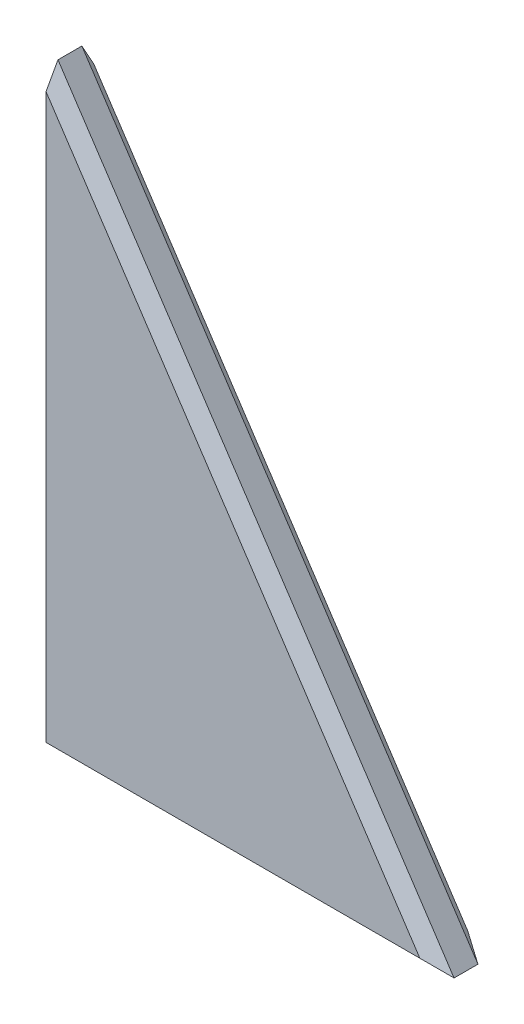
ISO-10303-21;
HEADER;
FILE_DESCRIPTION(('STEP AP214'),'2;1');
FILE_NAME('part.step','',(''),(''),'','','');
FILE_SCHEMA(('AUTOMOTIVE_DESIGN { 1 0 10303 214 1 1 1 1 }'));
ENDSEC;
DATA;
#1=APPLICATION_CONTEXT('core data for automotive mechanical design processes');
#2=APPLICATION_PROTOCOL_DEFINITION('international standard','automotive_design',2000,#1);
#3=PRODUCT_CONTEXT('',#1,'mechanical');
#4=PRODUCT('Part','Part','',(#3));
#5=PRODUCT_RELATED_PRODUCT_CATEGORY('part','',(#4));
#6=PRODUCT_DEFINITION_FORMATION('','',#4);
#7=PRODUCT_DEFINITION_CONTEXT('part definition',#1,'design');
#8=PRODUCT_DEFINITION('design','',#6,#7);
#9=PRODUCT_DEFINITION_SHAPE('','',#8);
#10=(LENGTH_UNIT() NAMED_UNIT(*) SI_UNIT(.MILLI.,.METRE.));
#11=(NAMED_UNIT(*) PLANE_ANGLE_UNIT() SI_UNIT($,.RADIAN.));
#12=(NAMED_UNIT(*) SI_UNIT($,.STERADIAN.) SOLID_ANGLE_UNIT());
#13=UNCERTAINTY_MEASURE_WITH_UNIT(LENGTH_MEASURE(1.E-05),#10,'distance_accuracy_value','');
#14=(GEOMETRIC_REPRESENTATION_CONTEXT(3) GLOBAL_UNCERTAINTY_ASSIGNED_CONTEXT((#13)) GLOBAL_UNIT_ASSIGNED_CONTEXT((#10,
#11,#12)) REPRESENTATION_CONTEXT('',''));
#15=CARTESIAN_POINT('',(0.,0.,0.));
#16=DIRECTION('',(0.,0.,1.));
#17=DIRECTION('',(1.,0.,0.));
#18=AXIS2_PLACEMENT_3D('',#15,#16,#17);
#19=CARTESIAN_POINT('',(0.,0.,2.54));
#20=DIRECTION('',(1.,0.,0.));
#21=DIRECTION('',(0.,0.,-1.));
#22=AXIS2_PLACEMENT_3D('',#19,#20,#21);
#23=PLANE('',#22);
#24=DIRECTION('',(0.,-1.,0.));
#25=VECTOR('',#24,1.);
#26=CARTESIAN_POINT('',(0.,0.,-2.54));
#27=LINE('',#26,#25);
#28=CARTESIAN_POINT('',(0.,61.2024835543174,-2.54));
#29=VERTEX_POINT('',#28);
#30=CARTESIAN_POINT('',(0.,1.27000000000001,-2.54));
#31=VERTEX_POINT('',#30);
#32=EDGE_CURVE('E111',#29,#31,#27,.T.);
#33=ORIENTED_EDGE('',*,*,#32,.T.);
#34=DIRECTION('',(0.,-0.707106781186547,0.707106781186548));
#35=VECTOR('',#34,1.);
#36=CARTESIAN_POINT('',(0.,0.,-1.26999999999999));
#37=LINE('',#36,#35);
#38=CARTESIAN_POINT('',(0.,0.,-1.26999999999999));
#39=VERTEX_POINT('',#38);
#40=EDGE_CURVE('E94',#31,#39,#37,.T.);
#41=ORIENTED_EDGE('',*,*,#40,.T.);
#42=DIRECTION('',(0.,0.,-1.));
#43=VECTOR('',#42,1.);
#44=CARTESIAN_POINT('',(0.,0.,2.54));
#45=LINE('',#44,#43);
#46=CARTESIAN_POINT('',(0.,0.,1.26999999999999));
#47=VERTEX_POINT('',#46);
#48=EDGE_CURVE('E104',#47,#39,#45,.T.);
#49=ORIENTED_EDGE('',*,*,#48,.F.);
#50=DIRECTION('',(0.,-0.707106781186548,-0.707106781186547));
#51=VECTOR('',#50,1.);
#52=CARTESIAN_POINT('',(0.,1.27000000000001,2.54));
#53=LINE('',#52,#51);
#54=CARTESIAN_POINT('',(0.,1.27000000000001,2.54));
#55=VERTEX_POINT('',#54);
#56=EDGE_CURVE('E108',#47,#55,#53,.F.);
#57=ORIENTED_EDGE('',*,*,#56,.T.);
#58=DIRECTION('',(0.,-1.,0.));
#59=VECTOR('',#58,1.);
#60=CARTESIAN_POINT('',(0.,0.,2.54));
#61=LINE('',#60,#59);
#62=CARTESIAN_POINT('',(0.,61.2024835543174,2.54));
#63=VERTEX_POINT('',#62);
#64=EDGE_CURVE('E116',#63,#55,#61,.T.);
#65=ORIENTED_EDGE('',*,*,#64,.F.);
#66=DIRECTION('',(0.,-0.875189948987367,0.483779446846897));
#67=VECTOR('',#66,1.);
#68=CARTESIAN_POINT('',(0.,28.6479710254252,20.5351838818766));
#69=LINE('',#68,#67);
#70=CARTESIAN_POINT('',(0.,63.5,1.26999999999999));
#71=VERTEX_POINT('',#70);
#72=EDGE_CURVE('E125',#63,#71,#69,.F.);
#73=ORIENTED_EDGE('',*,*,#72,.T.);
#74=DIRECTION('',(0.,0.,-1.));
#75=VECTOR('',#74,1.);
#76=CARTESIAN_POINT('',(0.,63.5,2.54));
#77=LINE('',#76,#75);
#78=CARTESIAN_POINT('',(0.,63.5,-1.26999999999999));
#79=VERTEX_POINT('',#78);
#80=EDGE_CURVE('E91',#71,#79,#77,.T.);
#81=ORIENTED_EDGE('',*,*,#80,.T.);
#82=DIRECTION('',(0.,-0.875189948987366,-0.483779446846899));
#83=VECTOR('',#82,1.);
#84=CARTESIAN_POINT('',(0.,63.5,-1.26999999999999));
#85=LINE('',#84,#83);
#86=EDGE_CURVE('E122',#79,#29,#85,.T.);
#87=ORIENTED_EDGE('',*,*,#86,.T.);
#88=EDGE_LOOP('',(#33,#41,#49,#57,#65,#73,#81,#87));
#89=FACE_BOUND('',#88,.T.);
#90=ADVANCED_FACE('F31',(#89),#23,.F.);
#91=CARTESIAN_POINT('',(0.,0.,2.54));
#92=DIRECTION('',(0.,1.,0.));
#93=DIRECTION('',(0.,0.,1.));
#94=AXIS2_PLACEMENT_3D('',#91,#92,#93);
#95=PLANE('',#94);
#96=ORIENTED_EDGE('',*,*,#48,.T.);
#97=DIRECTION('',(1.,0.,0.));
#98=VECTOR('',#97,1.);
#99=CARTESIAN_POINT('',(42.1211348375136,0.,-1.26999999999999));
#100=LINE('',#99,#98);
#101=CARTESIAN_POINT('',(42.1211348375136,0.,-1.26999999999999));
#102=VERTEX_POINT('',#101);
#103=EDGE_CURVE('E103',#39,#102,#100,.T.);
#104=ORIENTED_EDGE('',*,*,#103,.T.);
#105=DIRECTION('',(0.,0.,-1.));
#106=VECTOR('',#105,1.);
#107=CARTESIAN_POINT('',(42.1211348375136,0.,2.54));
#108=LINE('',#107,#106);
#109=CARTESIAN_POINT('',(42.1211348375136,0.,1.26999999999999));
#110=VERTEX_POINT('',#109);
#111=EDGE_CURVE('E90',#110,#102,#108,.T.);
#112=ORIENTED_EDGE('',*,*,#111,.F.);
#113=DIRECTION('',(-1.,0.,0.));
#114=VECTOR('',#113,1.);
#115=CARTESIAN_POINT('',(0.,0.,1.26999999999999));
#116=LINE('',#115,#114);
#117=EDGE_CURVE('E100',#110,#47,#116,.T.);
#118=ORIENTED_EDGE('',*,*,#117,.T.);
#119=EDGE_LOOP('',(#96,#104,#112,#118));
#120=FACE_BOUND('',#119,.T.);
#121=ADVANCED_FACE('F99',(#120),#95,.F.);
#122=CARTESIAN_POINT('',(0.,63.5,2.54));
#123=DIRECTION('',(-0.833333333333333,-0.552770798392567,0.));
#124=DIRECTION('',(0.552770798392567,-0.833333333333333,0.));
#125=AXIS2_PLACEMENT_3D('',#122,#123,#124);
#126=PLANE('',#125);
#127=ORIENTED_EDGE('',*,*,#111,.T.);
#128=DIRECTION('',(-0.552770798392567,0.833333333333333,0.));
#129=VECTOR('',#128,1.);
#130=CARTESIAN_POINT('',(0.,63.5,-1.26999999999999));
#131=LINE('',#130,#129);
#132=EDGE_CURVE('E55',#102,#79,#131,.T.);
#133=ORIENTED_EDGE('',*,*,#132,.T.);
#134=ORIENTED_EDGE('',*,*,#80,.F.);
#135=DIRECTION('',(0.552770798392567,-0.833333333333333,0.));
#136=VECTOR('',#135,1.);
#137=CARTESIAN_POINT('',(0.,63.5,1.26999999999999));
#138=LINE('',#137,#136);
#139=EDGE_CURVE('E87',#71,#110,#138,.T.);
#140=ORIENTED_EDGE('',*,*,#139,.T.);
#141=EDGE_LOOP('',(#127,#133,#134,#140));
#142=FACE_BOUND('',#141,.T.);
#143=ADVANCED_FACE('F89',(#142),#126,.F.);
#144=CARTESIAN_POINT('',(0.,0.,2.54));
#145=DIRECTION('',(0.,0.,-1.));
#146=DIRECTION('',(-1.,0.,0.));
#147=AXIS2_PLACEMENT_3D('',#144,#145,#146);
#148=PLANE('',#147);
#149=ORIENTED_EDGE('',*,*,#64,.T.);
#150=DIRECTION('',(1.,0.,0.));
#151=VECTOR('',#150,1.);
#152=CARTESIAN_POINT('',(0.,1.27000000000001,2.54));
#153=LINE('',#152,#151);
#154=CARTESIAN_POINT('',(39.7547121407633,1.27000000000001,2.54));
#155=VERTEX_POINT('',#154);
#156=EDGE_CURVE('E11',#55,#155,#153,.T.);
#157=ORIENTED_EDGE('',*,*,#156,.T.);
#158=DIRECTION('',(-0.552770798392567,0.833333333333333,0.));
#159=VECTOR('',#158,1.);
#160=CARTESIAN_POINT('',(28.1924547482733,18.7007588638192,2.54));
#161=LINE('',#160,#159);
#162=EDGE_CURVE('E40',#155,#63,#161,.T.);
#163=ORIENTED_EDGE('',*,*,#162,.T.);
#164=EDGE_LOOP('',(#149,#157,#163));
#165=FACE_BOUND('',#164,.T.);
#166=ADVANCED_FACE('F137',(#165),#148,.F.);
#167=CARTESIAN_POINT('',(0.,0.,-2.54));
#168=DIRECTION('',(0.,0.,-1.));
#169=DIRECTION('',(-1.,0.,0.));
#170=AXIS2_PLACEMENT_3D('',#167,#168,#169);
#171=PLANE('',#170);
#172=DIRECTION('',(0.552770798392567,-0.833333333333333,0.));
#173=VECTOR('',#172,1.);
#174=CARTESIAN_POINT('',(41.0628015041802,-0.702018913958564,-2.54));
#175=LINE('',#174,#173);
#176=CARTESIAN_POINT('',(39.7547121407633,1.27000000000001,-2.54));
#177=VERTEX_POINT('',#176);
#178=EDGE_CURVE('E129',#29,#177,#175,.T.);
#179=ORIENTED_EDGE('',*,*,#178,.T.);
#180=DIRECTION('',(-1.,0.,0.));
#181=VECTOR('',#180,1.);
#182=CARTESIAN_POINT('',(0.,1.27000000000001,-2.54));
#183=LINE('',#182,#181);
#184=EDGE_CURVE('E127',#177,#31,#183,.T.);
#185=ORIENTED_EDGE('',*,*,#184,.T.);
#186=ORIENTED_EDGE('',*,*,#32,.F.);
#187=EDGE_LOOP('',(#179,#185,#186));
#188=FACE_BOUND('',#187,.T.);
#189=ADVANCED_FACE('F147',(#188),#171,.T.);
#190=CARTESIAN_POINT('',(0.,63.5,-1.26999999999999));
#191=DIRECTION('',(0.589255650988791,0.390867979985287,-0.707106781186545));
#192=DIRECTION('',(-0.768221279597374,0.,-0.640184399664482));
#193=AXIS2_PLACEMENT_3D('',#190,#191,#192);
#194=PLANE('',#193);
#195=ORIENTED_EDGE('',*,*,#86,.F.);
#196=ORIENTED_EDGE('',*,*,#132,.F.);
#197=DIRECTION('',(-0.796556075470587,0.427491765201914,-0.427491765201915));
#198=VECTOR('',#197,1.);
#199=CARTESIAN_POINT('',(-6.22788566281209,25.9477126042345,-27.2177126042346));
#200=LINE('',#199,#198);
#201=EDGE_CURVE('E110',#177,#102,#200,.F.);
#202=ORIENTED_EDGE('',*,*,#201,.F.);
#203=ORIENTED_EDGE('',*,*,#178,.F.);
#204=EDGE_LOOP('',(#195,#196,#202,#203));
#205=FACE_BOUND('',#204,.T.);
#206=ADVANCED_FACE('F146',(#205),#194,.T.);
#207=CARTESIAN_POINT('',(0.,0.,-1.26999999999999));
#208=DIRECTION('',(0.,-0.707106781186548,-0.707106781186547));
#209=DIRECTION('',(0.,0.707106781186547,-0.707106781186548));
#210=AXIS2_PLACEMENT_3D('',#207,#208,#209);
#211=PLANE('',#210);
#212=ORIENTED_EDGE('',*,*,#40,.F.);
#213=ORIENTED_EDGE('',*,*,#184,.F.);
#214=ORIENTED_EDGE('',*,*,#201,.T.);
#215=ORIENTED_EDGE('',*,*,#103,.F.);
#216=EDGE_LOOP('',(#212,#213,#214,#215));
#217=FACE_BOUND('',#216,.T.);
#218=ADVANCED_FACE('F140',(#217),#211,.T.);
#219=CARTESIAN_POINT('',(28.1924547482733,18.7007588638192,2.54));
#220=DIRECTION('',(-0.58925565098879,-0.390867979985286,-0.707106781186547));
#221=DIRECTION('',(-0.768221279597376,0.,0.64018439966448));
#222=AXIS2_PLACEMENT_3D('',#219,#220,#221);
#223=PLANE('',#222);
#224=ORIENTED_EDGE('',*,*,#72,.F.);
#225=ORIENTED_EDGE('',*,*,#162,.F.);
#226=DIRECTION('',(0.796556075470587,-0.427491765201914,-0.427491765201913));
#227=VECTOR('',#226,1.);
#228=CARTESIAN_POINT('',(26.4828992644951,8.39265073184403,9.66265073184401));
#229=LINE('',#228,#227);
#230=EDGE_CURVE('E35',#110,#155,#229,.F.);
#231=ORIENTED_EDGE('',*,*,#230,.F.);
#232=ORIENTED_EDGE('',*,*,#139,.F.);
#233=EDGE_LOOP('',(#224,#225,#231,#232));
#234=FACE_BOUND('',#233,.T.);
#235=ADVANCED_FACE('F33',(#234),#223,.F.);
#236=CARTESIAN_POINT('',(0.,1.27000000000001,2.54));
#237=DIRECTION('',(0.,0.707106781186547,-0.707106781186548));
#238=DIRECTION('',(0.,0.707106781186548,0.707106781186547));
#239=AXIS2_PLACEMENT_3D('',#236,#237,#238);
#240=PLANE('',#239);
#241=ORIENTED_EDGE('',*,*,#56,.F.);
#242=ORIENTED_EDGE('',*,*,#117,.F.);
#243=ORIENTED_EDGE('',*,*,#230,.T.);
#244=ORIENTED_EDGE('',*,*,#156,.F.);
#245=EDGE_LOOP('',(#241,#242,#243,#244));
#246=FACE_BOUND('',#245,.T.);
#247=ADVANCED_FACE('F107',(#246),#240,.F.);
#248=CLOSED_SHELL('',(#90,#121,#143,#166,#189,#206,#218,#235,#247));
#249=MANIFOLD_SOLID_BREP('B2',#248);
#250=ADVANCED_BREP_SHAPE_REPRESENTATION('',(#18,#249),#14);
#251=SHAPE_DEFINITION_REPRESENTATION(#9,#250);
ENDSEC;
END-ISO-10303-21;
